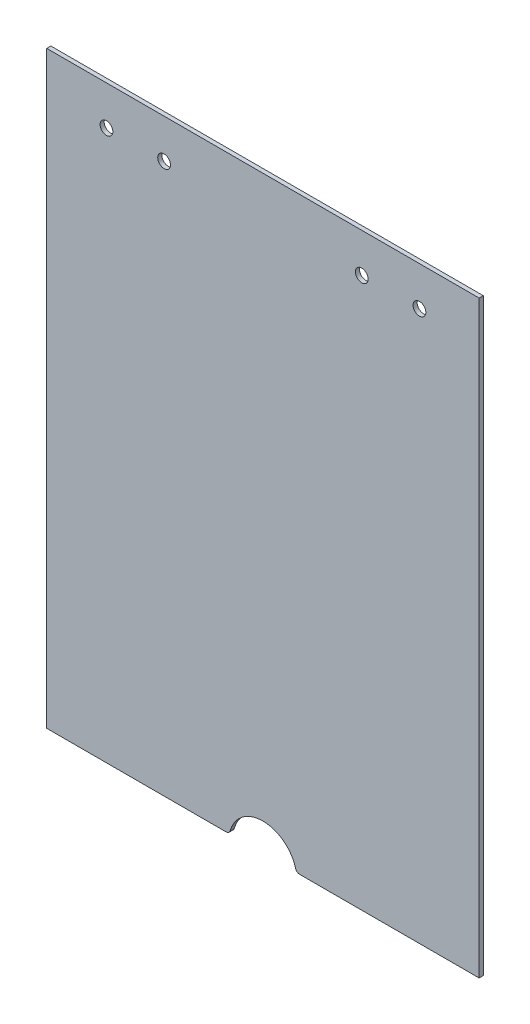
ISO-10303-21;
HEADER;
FILE_DESCRIPTION(('STEP AP214'),'2;1');
FILE_NAME('part.step','',(''),(''),'','','');
FILE_SCHEMA(('AUTOMOTIVE_DESIGN { 1 0 10303 214 1 1 1 1 }'));
ENDSEC;
DATA;
#1=APPLICATION_CONTEXT('core data for automotive mechanical design processes');
#2=APPLICATION_PROTOCOL_DEFINITION('international standard','automotive_design',2000,#1);
#3=PRODUCT_CONTEXT('',#1,'mechanical');
#4=PRODUCT('Part','Part','',(#3));
#5=PRODUCT_RELATED_PRODUCT_CATEGORY('part','',(#4));
#6=PRODUCT_DEFINITION_FORMATION('','',#4);
#7=PRODUCT_DEFINITION_CONTEXT('part definition',#1,'design');
#8=PRODUCT_DEFINITION('design','',#6,#7);
#9=PRODUCT_DEFINITION_SHAPE('','',#8);
#10=(LENGTH_UNIT() NAMED_UNIT(*) SI_UNIT(.MILLI.,.METRE.));
#11=(NAMED_UNIT(*) PLANE_ANGLE_UNIT() SI_UNIT($,.RADIAN.));
#12=(NAMED_UNIT(*) SI_UNIT($,.STERADIAN.) SOLID_ANGLE_UNIT());
#13=UNCERTAINTY_MEASURE_WITH_UNIT(LENGTH_MEASURE(1.E-05),#10,'distance_accuracy_value','');
#14=(GEOMETRIC_REPRESENTATION_CONTEXT(3) GLOBAL_UNCERTAINTY_ASSIGNED_CONTEXT((#13)) GLOBAL_UNIT_ASSIGNED_CONTEXT((#10,
#11,#12)) REPRESENTATION_CONTEXT('',''));
#15=CARTESIAN_POINT('',(0.,0.,0.));
#16=DIRECTION('',(0.,0.,1.));
#17=DIRECTION('',(1.,0.,0.));
#18=AXIS2_PLACEMENT_3D('',#15,#16,#17);
#19=CARTESIAN_POINT('',(8.92020499265311,-70.5,1.));
#20=DIRECTION('',(0.,0.,-1.));
#21=DIRECTION('',(-1.,0.,0.));
#22=AXIS2_PLACEMENT_3D('',#19,#20,#21);
#23=PLANE('',#22);
#24=DIRECTION('',(0.,1.,0.));
#25=VECTOR('',#24,1.);
#26=CARTESIAN_POINT('',(52.5,71.5,1.));
#27=LINE('',#26,#25);
#28=CARTESIAN_POINT('',(52.5,-71.5,1.));
#29=VERTEX_POINT('',#28);
#30=CARTESIAN_POINT('',(52.5,71.5,1.));
#31=VERTEX_POINT('',#30);
#32=EDGE_CURVE('E152',#29,#31,#27,.T.);
#33=ORIENTED_EDGE('',*,*,#32,.T.);
#34=DIRECTION('',(-1.,0.,0.));
#35=VECTOR('',#34,1.);
#36=CARTESIAN_POINT('',(-52.5,71.5,1.));
#37=LINE('',#36,#35);
#38=CARTESIAN_POINT('',(-52.5,71.5,1.));
#39=VERTEX_POINT('',#38);
#40=EDGE_CURVE('E100',#31,#39,#37,.T.);
#41=ORIENTED_EDGE('',*,*,#40,.T.);
#42=DIRECTION('',(0.,-1.,0.));
#43=VECTOR('',#42,1.);
#44=CARTESIAN_POINT('',(-52.5,71.5,1.));
#45=LINE('',#44,#43);
#46=CARTESIAN_POINT('',(-52.5,-71.5,1.));
#47=VERTEX_POINT('',#46);
#48=EDGE_CURVE('E167',#39,#47,#45,.T.);
#49=ORIENTED_EDGE('',*,*,#48,.T.);
#50=DIRECTION('',(1.,0.,0.));
#51=VECTOR('',#50,1.);
#52=CARTESIAN_POINT('',(-52.5,-71.5,1.));
#53=LINE('',#52,#51);
#54=CARTESIAN_POINT('',(-8.92020499265311,-71.5,1.));
#55=VERTEX_POINT('',#54);
#56=EDGE_CURVE('E180',#47,#55,#53,.T.);
#57=ORIENTED_EDGE('',*,*,#56,.T.);
#58=CARTESIAN_POINT('',(-8.92020499265311,-70.5,1.));
#59=DIRECTION('',(0.,0.,1.));
#60=DIRECTION('',(1.,0.,0.));
#61=AXIS2_PLACEMENT_3D('',#58,#59,#60);
#62=CIRCLE('',#61,0.999999999999994);
#63=CARTESIAN_POINT('',(-7.95730665867622,-70.76986440748,1.));
#64=VERTEX_POINT('',#63);
#65=EDGE_CURVE('E119',#55,#64,#62,.T.);
#66=ORIENTED_EDGE('',*,*,#65,.T.);
#67=CARTESIAN_POINT('',(0.,-73.,1.));
#68=DIRECTION('',(0.,0.,-1.));
#69=DIRECTION('',(1.,0.,0.));
#70=AXIS2_PLACEMENT_3D('',#67,#68,#69);
#71=CIRCLE('',#70,8.26391154485801);
#72=CARTESIAN_POINT('',(7.95730665867621,-70.76986440748,1.));
#73=VERTEX_POINT('',#72);
#74=EDGE_CURVE('E113',#64,#73,#71,.T.);
#75=ORIENTED_EDGE('',*,*,#74,.T.);
#76=CARTESIAN_POINT('',(8.92020499265311,-70.5,1.));
#77=DIRECTION('',(0.,0.,1.));
#78=DIRECTION('',(-1.,0.,0.));
#79=AXIS2_PLACEMENT_3D('',#76,#77,#78);
#80=CIRCLE('',#79,1.);
#81=CARTESIAN_POINT('',(8.92020499265311,-71.5,1.));
#82=VERTEX_POINT('',#81);
#83=EDGE_CURVE('E117',#73,#82,#80,.T.);
#84=ORIENTED_EDGE('',*,*,#83,.T.);
#85=DIRECTION('',(1.,0.,0.));
#86=VECTOR('',#85,1.);
#87=CARTESIAN_POINT('',(8.92020499265311,-71.5,1.));
#88=LINE('',#87,#86);
#89=EDGE_CURVE('E57',#82,#29,#88,.T.);
#90=ORIENTED_EDGE('',*,*,#89,.T.);
#91=EDGE_LOOP('',(#33,#41,#49,#57,#66,#75,#84,#90));
#92=FACE_BOUND('',#91,.T.);
#93=CARTESIAN_POINT('',(-38.,62.,1.));
#94=DIRECTION('',(0.,0.,1.));
#95=DIRECTION('',(1.,0.,0.));
#96=AXIS2_PLACEMENT_3D('',#93,#94,#95);
#97=CIRCLE('',#96,1.55);
#98=CARTESIAN_POINT('',(-36.45,62.,1.));
#99=VERTEX_POINT('',#98);
#100=EDGE_CURVE('E141',#99,#99,#97,.T.);
#101=ORIENTED_EDGE('',*,*,#100,.F.);
#102=EDGE_LOOP('',(#101));
#103=FACE_BOUND('',#102,.T.);
#104=CARTESIAN_POINT('',(-24.,62.0000000000001,1.));
#105=DIRECTION('',(0.,0.,1.));
#106=DIRECTION('',(1.,0.,0.));
#107=AXIS2_PLACEMENT_3D('',#104,#105,#106);
#108=CIRCLE('',#107,1.55);
#109=CARTESIAN_POINT('',(-22.45,62.0000000000001,1.));
#110=VERTEX_POINT('',#109);
#111=EDGE_CURVE('E189',#110,#110,#108,.T.);
#112=ORIENTED_EDGE('',*,*,#111,.F.);
#113=EDGE_LOOP('',(#112));
#114=FACE_BOUND('',#113,.T.);
#115=CARTESIAN_POINT('',(24.,62.,1.));
#116=DIRECTION('',(0.,0.,1.));
#117=DIRECTION('',(1.,0.,0.));
#118=AXIS2_PLACEMENT_3D('',#115,#116,#117);
#119=CIRCLE('',#118,1.55);
#120=CARTESIAN_POINT('',(25.55,62.,1.));
#121=VERTEX_POINT('',#120);
#122=EDGE_CURVE('E195',#121,#121,#119,.T.);
#123=ORIENTED_EDGE('',*,*,#122,.F.);
#124=EDGE_LOOP('',(#123));
#125=FACE_BOUND('',#124,.T.);
#126=CARTESIAN_POINT('',(38.,62.,1.));
#127=DIRECTION('',(0.,0.,1.));
#128=DIRECTION('',(1.,0.,0.));
#129=AXIS2_PLACEMENT_3D('',#126,#127,#128);
#130=CIRCLE('',#129,1.55);
#131=CARTESIAN_POINT('',(39.55,62.,1.));
#132=VERTEX_POINT('',#131);
#133=EDGE_CURVE('E201',#132,#132,#130,.T.);
#134=ORIENTED_EDGE('',*,*,#133,.F.);
#135=EDGE_LOOP('',(#134));
#136=FACE_BOUND('',#135,.T.);
#137=ADVANCED_FACE('F40',(#92,#103,#114,#125,#136),#23,.F.);
#138=CARTESIAN_POINT('',(8.92020499265311,-70.5,0.));
#139=DIRECTION('',(0.,0.,-1.));
#140=DIRECTION('',(-1.,0.,0.));
#141=AXIS2_PLACEMENT_3D('',#138,#139,#140);
#142=PLANE('',#141);
#143=CARTESIAN_POINT('',(24.,62.,0.));
#144=DIRECTION('',(0.,0.,1.));
#145=DIRECTION('',(1.,0.,0.));
#146=AXIS2_PLACEMENT_3D('',#143,#144,#145);
#147=CIRCLE('',#146,1.55);
#148=CARTESIAN_POINT('',(25.55,62.,0.));
#149=VERTEX_POINT('',#148);
#150=EDGE_CURVE('E198',#149,#149,#147,.T.);
#151=ORIENTED_EDGE('',*,*,#150,.T.);
#152=EDGE_LOOP('',(#151));
#153=FACE_BOUND('',#152,.T.);
#154=CARTESIAN_POINT('',(-38.,62.,0.));
#155=DIRECTION('',(0.,0.,1.));
#156=DIRECTION('',(1.,0.,0.));
#157=AXIS2_PLACEMENT_3D('',#154,#155,#156);
#158=CIRCLE('',#157,1.55);
#159=CARTESIAN_POINT('',(-36.45,62.,0.));
#160=VERTEX_POINT('',#159);
#161=EDGE_CURVE('E186',#160,#160,#158,.T.);
#162=ORIENTED_EDGE('',*,*,#161,.T.);
#163=EDGE_LOOP('',(#162));
#164=FACE_BOUND('',#163,.T.);
#165=DIRECTION('',(0.,1.,0.));
#166=VECTOR('',#165,1.);
#167=CARTESIAN_POINT('',(52.5,71.5,0.));
#168=LINE('',#167,#166);
#169=CARTESIAN_POINT('',(52.5,-71.5,0.));
#170=VERTEX_POINT('',#169);
#171=CARTESIAN_POINT('',(52.5,71.5,0.));
#172=VERTEX_POINT('',#171);
#173=EDGE_CURVE('E137',#170,#172,#168,.T.);
#174=ORIENTED_EDGE('',*,*,#173,.F.);
#175=DIRECTION('',(1.,0.,0.));
#176=VECTOR('',#175,1.);
#177=CARTESIAN_POINT('',(8.92020499265311,-71.5,0.));
#178=LINE('',#177,#176);
#179=CARTESIAN_POINT('',(8.92020499265311,-71.5,0.));
#180=VERTEX_POINT('',#179);
#181=EDGE_CURVE('E92',#180,#170,#178,.T.);
#182=ORIENTED_EDGE('',*,*,#181,.F.);
#183=CARTESIAN_POINT('',(8.92020499265311,-70.5,0.));
#184=DIRECTION('',(0.,0.,1.));
#185=DIRECTION('',(-1.,0.,0.));
#186=AXIS2_PLACEMENT_3D('',#183,#184,#185);
#187=CIRCLE('',#186,1.);
#188=CARTESIAN_POINT('',(7.95730665867621,-70.76986440748,0.));
#189=VERTEX_POINT('',#188);
#190=EDGE_CURVE('E86',#189,#180,#187,.T.);
#191=ORIENTED_EDGE('',*,*,#190,.F.);
#192=CARTESIAN_POINT('',(0.,-73.,0.));
#193=DIRECTION('',(0.,0.,-1.));
#194=DIRECTION('',(1.,0.,0.));
#195=AXIS2_PLACEMENT_3D('',#192,#193,#194);
#196=CIRCLE('',#195,8.26391154485801);
#197=CARTESIAN_POINT('',(-7.95730665867622,-70.76986440748,0.));
#198=VERTEX_POINT('',#197);
#199=EDGE_CURVE('E127',#198,#189,#196,.T.);
#200=ORIENTED_EDGE('',*,*,#199,.F.);
#201=CARTESIAN_POINT('',(-8.92020499265311,-70.5,0.));
#202=DIRECTION('',(0.,0.,1.));
#203=DIRECTION('',(1.,0.,0.));
#204=AXIS2_PLACEMENT_3D('',#201,#202,#203);
#205=CIRCLE('',#204,0.999999999999994);
#206=CARTESIAN_POINT('',(-8.92020499265311,-71.5,0.));
#207=VERTEX_POINT('',#206);
#208=EDGE_CURVE('E147',#207,#198,#205,.T.);
#209=ORIENTED_EDGE('',*,*,#208,.F.);
#210=DIRECTION('',(1.,0.,0.));
#211=VECTOR('',#210,1.);
#212=CARTESIAN_POINT('',(-52.5,-71.5,0.));
#213=LINE('',#212,#211);
#214=CARTESIAN_POINT('',(-52.5,-71.5,0.));
#215=VERTEX_POINT('',#214);
#216=EDGE_CURVE('E145',#215,#207,#213,.T.);
#217=ORIENTED_EDGE('',*,*,#216,.F.);
#218=DIRECTION('',(0.,-1.,0.));
#219=VECTOR('',#218,1.);
#220=CARTESIAN_POINT('',(-52.5,71.5,0.));
#221=LINE('',#220,#219);
#222=CARTESIAN_POINT('',(-52.5,71.5,0.));
#223=VERTEX_POINT('',#222);
#224=EDGE_CURVE('E143',#223,#215,#221,.T.);
#225=ORIENTED_EDGE('',*,*,#224,.F.);
#226=DIRECTION('',(-1.,0.,0.));
#227=VECTOR('',#226,1.);
#228=CARTESIAN_POINT('',(-52.5,71.5,0.));
#229=LINE('',#228,#227);
#230=EDGE_CURVE('E140',#172,#223,#229,.T.);
#231=ORIENTED_EDGE('',*,*,#230,.F.);
#232=EDGE_LOOP('',(#174,#182,#191,#200,#209,#217,#225,#231));
#233=FACE_BOUND('',#232,.T.);
#234=CARTESIAN_POINT('',(-24.,62.0000000000001,0.));
#235=DIRECTION('',(0.,0.,1.));
#236=DIRECTION('',(1.,0.,0.));
#237=AXIS2_PLACEMENT_3D('',#234,#235,#236);
#238=CIRCLE('',#237,1.55);
#239=CARTESIAN_POINT('',(-22.45,62.0000000000001,0.));
#240=VERTEX_POINT('',#239);
#241=EDGE_CURVE('E192',#240,#240,#238,.T.);
#242=ORIENTED_EDGE('',*,*,#241,.T.);
#243=EDGE_LOOP('',(#242));
#244=FACE_BOUND('',#243,.T.);
#245=CARTESIAN_POINT('',(38.,62.,0.));
#246=DIRECTION('',(0.,0.,1.));
#247=DIRECTION('',(1.,0.,0.));
#248=AXIS2_PLACEMENT_3D('',#245,#246,#247);
#249=CIRCLE('',#248,1.55);
#250=CARTESIAN_POINT('',(39.55,62.,0.));
#251=VERTEX_POINT('',#250);
#252=EDGE_CURVE('E204',#251,#251,#249,.T.);
#253=ORIENTED_EDGE('',*,*,#252,.T.);
#254=EDGE_LOOP('',(#253));
#255=FACE_BOUND('',#254,.T.);
#256=ADVANCED_FACE('F171',(#153,#164,#233,#244,#255),#142,.T.);
#257=CARTESIAN_POINT('',(52.5,71.5,1.));
#258=DIRECTION('',(-1.,0.,0.));
#259=DIRECTION('',(0.,-1.,0.));
#260=AXIS2_PLACEMENT_3D('',#257,#258,#259);
#261=PLANE('',#260);
#262=ORIENTED_EDGE('',*,*,#173,.T.);
#263=DIRECTION('',(0.,0.,-1.));
#264=VECTOR('',#263,1.);
#265=CARTESIAN_POINT('',(52.5,71.5,1.));
#266=LINE('',#265,#264);
#267=EDGE_CURVE('E11',#31,#172,#266,.T.);
#268=ORIENTED_EDGE('',*,*,#267,.F.);
#269=ORIENTED_EDGE('',*,*,#32,.F.);
#270=DIRECTION('',(0.,0.,-1.));
#271=VECTOR('',#270,1.);
#272=CARTESIAN_POINT('',(52.5,-71.5,1.));
#273=LINE('',#272,#271);
#274=EDGE_CURVE('E133',#29,#170,#273,.T.);
#275=ORIENTED_EDGE('',*,*,#274,.T.);
#276=EDGE_LOOP('',(#262,#268,#269,#275));
#277=FACE_BOUND('',#276,.T.);
#278=ADVANCED_FACE('F42',(#277),#261,.F.);
#279=CARTESIAN_POINT('',(-52.5,71.5,1.));
#280=DIRECTION('',(0.,-1.,0.));
#281=DIRECTION('',(0.,0.,-1.));
#282=AXIS2_PLACEMENT_3D('',#279,#280,#281);
#283=PLANE('',#282);
#284=ORIENTED_EDGE('',*,*,#230,.T.);
#285=DIRECTION('',(0.,0.,-1.));
#286=VECTOR('',#285,1.);
#287=CARTESIAN_POINT('',(-52.5,71.5,1.));
#288=LINE('',#287,#286);
#289=EDGE_CURVE('E49',#39,#223,#288,.T.);
#290=ORIENTED_EDGE('',*,*,#289,.F.);
#291=ORIENTED_EDGE('',*,*,#40,.F.);
#292=ORIENTED_EDGE('',*,*,#267,.T.);
#293=EDGE_LOOP('',(#284,#290,#291,#292));
#294=FACE_BOUND('',#293,.T.);
#295=ADVANCED_FACE('F236',(#294),#283,.F.);
#296=CARTESIAN_POINT('',(-52.5,71.5,1.));
#297=DIRECTION('',(1.,0.,0.));
#298=DIRECTION('',(0.,1.,0.));
#299=AXIS2_PLACEMENT_3D('',#296,#297,#298);
#300=PLANE('',#299);
#301=ORIENTED_EDGE('',*,*,#224,.T.);
#302=DIRECTION('',(0.,0.,-1.));
#303=VECTOR('',#302,1.);
#304=CARTESIAN_POINT('',(-52.5,-71.5,1.));
#305=LINE('',#304,#303);
#306=EDGE_CURVE('E159',#47,#215,#305,.T.);
#307=ORIENTED_EDGE('',*,*,#306,.F.);
#308=ORIENTED_EDGE('',*,*,#48,.F.);
#309=ORIENTED_EDGE('',*,*,#289,.T.);
#310=EDGE_LOOP('',(#301,#307,#308,#309));
#311=FACE_BOUND('',#310,.T.);
#312=ADVANCED_FACE('F165',(#311),#300,.F.);
#313=CARTESIAN_POINT('',(-52.5,-71.5,1.));
#314=DIRECTION('',(0.,1.,0.));
#315=DIRECTION('',(-1.,0.,0.));
#316=AXIS2_PLACEMENT_3D('',#313,#314,#315);
#317=PLANE('',#316);
#318=ORIENTED_EDGE('',*,*,#216,.T.);
#319=DIRECTION('',(0.,0.,-1.));
#320=VECTOR('',#319,1.);
#321=CARTESIAN_POINT('',(-8.92020499265311,-71.5,1.));
#322=LINE('',#321,#320);
#323=EDGE_CURVE('E156',#55,#207,#322,.T.);
#324=ORIENTED_EDGE('',*,*,#323,.F.);
#325=ORIENTED_EDGE('',*,*,#56,.F.);
#326=ORIENTED_EDGE('',*,*,#306,.T.);
#327=EDGE_LOOP('',(#318,#324,#325,#326));
#328=FACE_BOUND('',#327,.T.);
#329=ADVANCED_FACE('F176',(#328),#317,.F.);
#330=CARTESIAN_POINT('',(-8.92020499265311,-70.5,1.));
#331=DIRECTION('',(0.,0.,-1.));
#332=DIRECTION('',(-1.,0.,0.));
#333=AXIS2_PLACEMENT_3D('',#330,#331,#332);
#334=CYLINDRICAL_SURFACE('',#333,0.999999999999994);
#335=ORIENTED_EDGE('',*,*,#208,.T.);
#336=DIRECTION('',(0.,0.,-1.));
#337=VECTOR('',#336,1.);
#338=CARTESIAN_POINT('',(-7.95730665867622,-70.76986440748,1.));
#339=LINE('',#338,#337);
#340=EDGE_CURVE('E128',#64,#198,#339,.T.);
#341=ORIENTED_EDGE('',*,*,#340,.F.);
#342=ORIENTED_EDGE('',*,*,#65,.F.);
#343=ORIENTED_EDGE('',*,*,#323,.T.);
#344=EDGE_LOOP('',(#335,#341,#342,#343));
#345=FACE_BOUND('',#344,.T.);
#346=ADVANCED_FACE('F179',(#345),#334,.T.);
#347=CARTESIAN_POINT('',(0.,-73.,1.));
#348=DIRECTION('',(0.,0.,-1.));
#349=DIRECTION('',(-1.,0.,0.));
#350=AXIS2_PLACEMENT_3D('',#347,#348,#349);
#351=CYLINDRICAL_SURFACE('',#350,8.26391154485801);
#352=ORIENTED_EDGE('',*,*,#199,.T.);
#353=DIRECTION('',(0.,0.,-1.));
#354=VECTOR('',#353,1.);
#355=CARTESIAN_POINT('',(7.95730665867621,-70.76986440748,1.));
#356=LINE('',#355,#354);
#357=EDGE_CURVE('E124',#73,#189,#356,.T.);
#358=ORIENTED_EDGE('',*,*,#357,.F.);
#359=ORIENTED_EDGE('',*,*,#74,.F.);
#360=ORIENTED_EDGE('',*,*,#340,.T.);
#361=EDGE_LOOP('',(#352,#358,#359,#360));
#362=FACE_BOUND('',#361,.T.);
#363=ADVANCED_FACE('F125',(#362),#351,.F.);
#364=CARTESIAN_POINT('',(8.92020499265311,-70.5,1.));
#365=DIRECTION('',(0.,0.,-1.));
#366=DIRECTION('',(-1.,0.,0.));
#367=AXIS2_PLACEMENT_3D('',#364,#365,#366);
#368=CYLINDRICAL_SURFACE('',#367,1.);
#369=ORIENTED_EDGE('',*,*,#190,.T.);
#370=DIRECTION('',(0.,0.,-1.));
#371=VECTOR('',#370,1.);
#372=CARTESIAN_POINT('',(8.92020499265311,-71.5,1.));
#373=LINE('',#372,#371);
#374=EDGE_CURVE('E129',#82,#180,#373,.T.);
#375=ORIENTED_EDGE('',*,*,#374,.F.);
#376=ORIENTED_EDGE('',*,*,#83,.F.);
#377=ORIENTED_EDGE('',*,*,#357,.T.);
#378=EDGE_LOOP('',(#369,#375,#376,#377));
#379=FACE_BOUND('',#378,.T.);
#380=ADVANCED_FACE('F131',(#379),#368,.T.);
#381=CARTESIAN_POINT('',(8.92020499265311,-71.5,1.));
#382=DIRECTION('',(0.,1.,0.));
#383=DIRECTION('',(0.,0.,1.));
#384=AXIS2_PLACEMENT_3D('',#381,#382,#383);
#385=PLANE('',#384);
#386=ORIENTED_EDGE('',*,*,#181,.T.);
#387=ORIENTED_EDGE('',*,*,#274,.F.);
#388=ORIENTED_EDGE('',*,*,#89,.F.);
#389=ORIENTED_EDGE('',*,*,#374,.T.);
#390=EDGE_LOOP('',(#386,#387,#388,#389));
#391=FACE_BOUND('',#390,.T.);
#392=ADVANCED_FACE('F224',(#391),#385,.F.);
#393=CARTESIAN_POINT('',(-38.,62.,1.));
#394=DIRECTION('',(0.,0.,-1.));
#395=DIRECTION('',(-1.,0.,0.));
#396=AXIS2_PLACEMENT_3D('',#393,#394,#395);
#397=CYLINDRICAL_SURFACE('',#396,1.55);
#398=ORIENTED_EDGE('',*,*,#100,.T.);
#399=EDGE_LOOP('',(#398));
#400=FACE_BOUND('',#399,.T.);
#401=ORIENTED_EDGE('',*,*,#161,.F.);
#402=EDGE_LOOP('',(#401));
#403=FACE_BOUND('',#402,.T.);
#404=ADVANCED_FACE('F221',(#400,#403),#397,.F.);
#405=CARTESIAN_POINT('',(-24.,62.0000000000001,1.));
#406=DIRECTION('',(0.,0.,-1.));
#407=DIRECTION('',(-1.,0.,0.));
#408=AXIS2_PLACEMENT_3D('',#405,#406,#407);
#409=CYLINDRICAL_SURFACE('',#408,1.55);
#410=ORIENTED_EDGE('',*,*,#111,.T.);
#411=EDGE_LOOP('',(#410));
#412=FACE_BOUND('',#411,.T.);
#413=ORIENTED_EDGE('',*,*,#241,.F.);
#414=EDGE_LOOP('',(#413));
#415=FACE_BOUND('',#414,.T.);
#416=ADVANCED_FACE('F312',(#412,#415),#409,.F.);
#417=CARTESIAN_POINT('',(24.,62.,1.));
#418=DIRECTION('',(0.,0.,-1.));
#419=DIRECTION('',(-1.,0.,0.));
#420=AXIS2_PLACEMENT_3D('',#417,#418,#419);
#421=CYLINDRICAL_SURFACE('',#420,1.55);
#422=ORIENTED_EDGE('',*,*,#122,.T.);
#423=EDGE_LOOP('',(#422));
#424=FACE_BOUND('',#423,.T.);
#425=ORIENTED_EDGE('',*,*,#150,.F.);
#426=EDGE_LOOP('',(#425));
#427=FACE_BOUND('',#426,.T.);
#428=ADVANCED_FACE('F321',(#424,#427),#421,.F.);
#429=CARTESIAN_POINT('',(38.,62.,1.));
#430=DIRECTION('',(0.,0.,-1.));
#431=DIRECTION('',(-1.,0.,0.));
#432=AXIS2_PLACEMENT_3D('',#429,#430,#431);
#433=CYLINDRICAL_SURFACE('',#432,1.55);
#434=ORIENTED_EDGE('',*,*,#133,.T.);
#435=EDGE_LOOP('',(#434));
#436=FACE_BOUND('',#435,.T.);
#437=ORIENTED_EDGE('',*,*,#252,.F.);
#438=EDGE_LOOP('',(#437));
#439=FACE_BOUND('',#438,.T.);
#440=ADVANCED_FACE('F210',(#436,#439),#433,.F.);
#441=CLOSED_SHELL('',(#137,#256,#278,#295,#312,#329,#346,#363,#380,#392,#404,#416,#428,#440));
#442=MANIFOLD_SOLID_BREP('B2',#441);
#443=ADVANCED_BREP_SHAPE_REPRESENTATION('',(#18,#442),#14);
#444=SHAPE_DEFINITION_REPRESENTATION(#9,#443);
ENDSEC;
END-ISO-10303-21;
